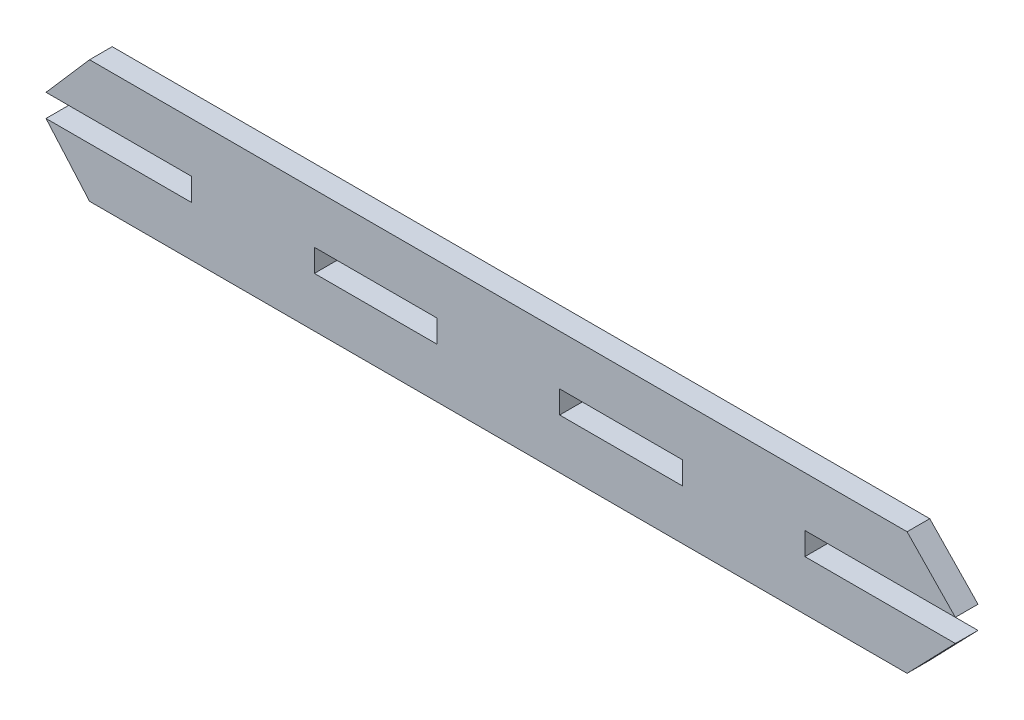
ISO-10303-21;
HEADER;
FILE_DESCRIPTION(('STEP AP214'),'2;1');
FILE_NAME('part.step','',(''),(''),'','','');
FILE_SCHEMA(('AUTOMOTIVE_DESIGN { 1 0 10303 214 1 1 1 1 }'));
ENDSEC;
DATA;
#1=APPLICATION_CONTEXT('core data for automotive mechanical design processes');
#2=APPLICATION_PROTOCOL_DEFINITION('international standard','automotive_design',2000,#1);
#3=PRODUCT_CONTEXT('',#1,'mechanical');
#4=PRODUCT('Part','Part','',(#3));
#5=PRODUCT_RELATED_PRODUCT_CATEGORY('part','',(#4));
#6=PRODUCT_DEFINITION_FORMATION('','',#4);
#7=PRODUCT_DEFINITION_CONTEXT('part definition',#1,'design');
#8=PRODUCT_DEFINITION('design','',#6,#7);
#9=PRODUCT_DEFINITION_SHAPE('','',#8);
#10=(LENGTH_UNIT() NAMED_UNIT(*) SI_UNIT(.MILLI.,.METRE.));
#11=(NAMED_UNIT(*) PLANE_ANGLE_UNIT() SI_UNIT($,.RADIAN.));
#12=(NAMED_UNIT(*) SI_UNIT($,.STERADIAN.) SOLID_ANGLE_UNIT());
#13=UNCERTAINTY_MEASURE_WITH_UNIT(LENGTH_MEASURE(1.E-05),#10,'distance_accuracy_value','');
#14=(GEOMETRIC_REPRESENTATION_CONTEXT(3) GLOBAL_UNCERTAINTY_ASSIGNED_CONTEXT((#13)) GLOBAL_UNIT_ASSIGNED_CONTEXT((#10,
#11,#12)) REPRESENTATION_CONTEXT('',''));
#15=CARTESIAN_POINT('',(0.,0.,0.));
#16=DIRECTION('',(0.,0.,1.));
#17=DIRECTION('',(1.,0.,0.));
#18=AXIS2_PLACEMENT_3D('',#15,#16,#17);
#19=CARTESIAN_POINT('',(0.,0.,5.54));
#20=DIRECTION('',(0.,0.,-1.));
#21=DIRECTION('',(-1.,0.,0.));
#22=AXIS2_PLACEMENT_3D('',#19,#20,#21);
#23=PLANE('',#22);
#24=DIRECTION('',(0.,-1.,0.));
#25=VECTOR('',#24,1.);
#26=CARTESIAN_POINT('',(185.883682838051,9.13527353806291,5.54));
#27=LINE('',#26,#25);
#28=CARTESIAN_POINT('',(185.883682838051,9.13527353806291,5.54));
#29=VERTEX_POINT('',#28);
#30=CARTESIAN_POINT('',(185.883682838051,3.59527353806291,5.54));
#31=VERTEX_POINT('',#30);
#32=EDGE_CURVE('E206',#29,#31,#27,.T.);
#33=ORIENTED_EDGE('',*,*,#32,.F.);
#34=DIRECTION('',(-1.,0.,0.));
#35=VECTOR('',#34,1.);
#36=CARTESIAN_POINT('',(185.883682838051,9.13527353806291,5.54));
#37=LINE('',#36,#35);
#38=CARTESIAN_POINT('',(215.883682838051,9.13527353806417,5.54));
#39=VERTEX_POINT('',#38);
#40=EDGE_CURVE('E214',#39,#29,#37,.T.);
#41=ORIENTED_EDGE('',*,*,#40,.F.);
#42=DIRECTION('',(0.,1.,0.));
#43=VECTOR('',#42,1.);
#44=CARTESIAN_POINT('',(215.883682838051,9.13527353806417,5.54));
#45=LINE('',#44,#43);
#46=CARTESIAN_POINT('',(215.883682838051,3.59527353806032,5.54));
#47=VERTEX_POINT('',#46);
#48=EDGE_CURVE('E211',#47,#39,#45,.T.);
#49=ORIENTED_EDGE('',*,*,#48,.F.);
#50=DIRECTION('',(1.,0.,0.));
#51=VECTOR('',#50,1.);
#52=CARTESIAN_POINT('',(185.883682838051,3.59527353806291,5.54));
#53=LINE('',#52,#51);
#54=EDGE_CURVE('E208',#31,#47,#53,.T.);
#55=ORIENTED_EDGE('',*,*,#54,.F.);
#56=EDGE_LOOP('',(#33,#41,#49,#55));
#57=FACE_BOUND('',#56,.T.);
#58=DIRECTION('',(-0.656899997261739,-0.753977714257874,0.));
#59=VECTOR('',#58,1.);
#60=CARTESIAN_POINT('',(60.2283453995707,9.13527353805765,5.54));
#61=LINE('',#60,#59);
#62=CARTESIAN_POINT('',(70.8836828380505,21.3652735380581,5.54));
#63=VERTEX_POINT('',#62);
#64=CARTESIAN_POINT('',(60.2283453995707,9.13527353805765,5.54));
#65=VERTEX_POINT('',#64);
#66=EDGE_CURVE('E237',#63,#65,#61,.T.);
#67=ORIENTED_EDGE('',*,*,#66,.T.);
#68=DIRECTION('',(1.,0.,0.));
#69=VECTOR('',#68,1.);
#70=CARTESIAN_POINT('',(60.2283453995707,9.13527353805765,5.54));
#71=LINE('',#70,#69);
#72=CARTESIAN_POINT('',(95.8836828380511,9.13527353805915,5.54));
#73=VERTEX_POINT('',#72);
#74=EDGE_CURVE('E240',#65,#73,#71,.T.);
#75=ORIENTED_EDGE('',*,*,#74,.T.);
#76=DIRECTION('',(0.,-1.,0.));
#77=VECTOR('',#76,1.);
#78=CARTESIAN_POINT('',(95.8836828380513,3.59527353805915,5.54));
#79=LINE('',#78,#77);
#80=CARTESIAN_POINT('',(95.8836828380513,3.59527353805915,5.54));
#81=VERTEX_POINT('',#80);
#82=EDGE_CURVE('E243',#73,#81,#79,.T.);
#83=ORIENTED_EDGE('',*,*,#82,.T.);
#84=DIRECTION('',(-1.,0.,0.));
#85=VECTOR('',#84,1.);
#86=CARTESIAN_POINT('',(60.2283453995709,3.59527353805765,5.54));
#87=LINE('',#86,#85);
#88=CARTESIAN_POINT('',(60.2283453995709,3.59527353805765,5.54));
#89=VERTEX_POINT('',#88);
#90=EDGE_CURVE('E245',#81,#89,#87,.T.);
#91=ORIENTED_EDGE('',*,*,#90,.T.);
#92=DIRECTION('',(0.65689999726181,-0.753977714257811,0.));
#93=VECTOR('',#92,1.);
#94=CARTESIAN_POINT('',(60.2283453995709,3.59527353805765,5.54));
#95=LINE('',#94,#93);
#96=CARTESIAN_POINT('',(70.883682838052,-8.6347264619419,5.54));
#97=VERTEX_POINT('',#96);
#98=EDGE_CURVE('E247',#89,#97,#95,.T.);
#99=ORIENTED_EDGE('',*,*,#98,.T.);
#100=DIRECTION('',(1.,0.,0.));
#101=VECTOR('',#100,1.);
#102=CARTESIAN_POINT('',(70.883682838052,-8.6347264619419,5.54));
#103=LINE('',#102,#101);
#104=CARTESIAN_POINT('',(270.883682838052,-8.63472646193352,5.54));
#105=VERTEX_POINT('',#104);
#106=EDGE_CURVE('E249',#97,#105,#103,.T.);
#107=ORIENTED_EDGE('',*,*,#106,.T.);
#108=DIRECTION('',(0.694449276487092,0.719541661327928,0.));
#109=VECTOR('',#108,1.);
#110=CARTESIAN_POINT('',(270.883682838052,-8.63472646193352,5.54));
#111=LINE('',#110,#109);
#112=CARTESIAN_POINT('',(282.687189303214,3.59527353806706,5.54));
#113=VERTEX_POINT('',#112);
#114=EDGE_CURVE('E251',#105,#113,#111,.T.);
#115=ORIENTED_EDGE('',*,*,#114,.T.);
#116=DIRECTION('',(-1.,0.,0.));
#117=VECTOR('',#116,1.);
#118=CARTESIAN_POINT('',(282.687189303214,3.59527353806706,5.54));
#119=LINE('',#118,#117);
#120=CARTESIAN_POINT('',(245.883682838051,3.59527353806552,5.54));
#121=VERTEX_POINT('',#120);
#122=EDGE_CURVE('E253',#113,#121,#119,.T.);
#123=ORIENTED_EDGE('',*,*,#122,.T.);
#124=DIRECTION('',(0.,1.,0.));
#125=VECTOR('',#124,1.);
#126=CARTESIAN_POINT('',(245.883682838051,3.59527353806552,5.54));
#127=LINE('',#126,#125);
#128=CARTESIAN_POINT('',(245.883682838051,9.13527353806552,5.54));
#129=VERTEX_POINT('',#128);
#130=EDGE_CURVE('E255',#121,#129,#127,.T.);
#131=ORIENTED_EDGE('',*,*,#130,.T.);
#132=DIRECTION('',(1.,0.,0.));
#133=VECTOR('',#132,1.);
#134=CARTESIAN_POINT('',(282.687189303214,9.13527353806706,5.54));
#135=LINE('',#134,#133);
#136=CARTESIAN_POINT('',(282.687189303214,9.13527353806706,5.54));
#137=VERTEX_POINT('',#136);
#138=EDGE_CURVE('E257',#129,#137,#135,.T.);
#139=ORIENTED_EDGE('',*,*,#138,.T.);
#140=DIRECTION('',(-0.694449276487162,0.71954166132786,0.));
#141=VECTOR('',#140,1.);
#142=CARTESIAN_POINT('',(270.883682838051,21.3652735380665,5.54));
#143=LINE('',#142,#141);
#144=CARTESIAN_POINT('',(270.883682838051,21.3652735380665,5.54));
#145=VERTEX_POINT('',#144);
#146=EDGE_CURVE('E259',#137,#145,#143,.T.);
#147=ORIENTED_EDGE('',*,*,#146,.T.);
#148=DIRECTION('',(-1.,0.,0.));
#149=VECTOR('',#148,1.);
#150=CARTESIAN_POINT('',(70.8836828380505,21.3652735380581,5.54));
#151=LINE('',#150,#149);
#152=EDGE_CURVE('E261',#145,#63,#151,.T.);
#153=ORIENTED_EDGE('',*,*,#152,.T.);
#154=EDGE_LOOP('',(#67,#75,#83,#91,#99,#107,#115,#123,#131,#139,#147,#153));
#155=FACE_BOUND('',#154,.T.);
#156=DIRECTION('',(-1.,0.,0.));
#157=VECTOR('',#156,1.);
#158=CARTESIAN_POINT('',(125.883682838051,9.1352735380599,5.54));
#159=LINE('',#158,#157);
#160=CARTESIAN_POINT('',(155.883682838051,9.13527353806074,5.54));
#161=VERTEX_POINT('',#160);
#162=CARTESIAN_POINT('',(125.883682838051,9.1352735380599,5.54));
#163=VERTEX_POINT('',#162);
#164=EDGE_CURVE('E170',#161,#163,#159,.T.);
#165=ORIENTED_EDGE('',*,*,#164,.F.);
#166=DIRECTION('',(0.,1.,0.));
#167=VECTOR('',#166,1.);
#168=CARTESIAN_POINT('',(155.883682838051,9.13527353806074,5.54));
#169=LINE('',#168,#167);
#170=CARTESIAN_POINT('',(155.883682838051,3.5952735380599,5.54));
#171=VERTEX_POINT('',#170);
#172=EDGE_CURVE('E192',#171,#161,#169,.T.);
#173=ORIENTED_EDGE('',*,*,#172,.F.);
#174=DIRECTION('',(1.,0.,0.));
#175=VECTOR('',#174,1.);
#176=CARTESIAN_POINT('',(125.883682838051,3.5952735380599,5.54));
#177=LINE('',#176,#175);
#178=CARTESIAN_POINT('',(125.883682838051,3.5952735380599,5.54));
#179=VERTEX_POINT('',#178);
#180=EDGE_CURVE('E190',#179,#171,#177,.T.);
#181=ORIENTED_EDGE('',*,*,#180,.F.);
#182=DIRECTION('',(0.,-1.,0.));
#183=VECTOR('',#182,1.);
#184=CARTESIAN_POINT('',(125.883682838051,9.1352735380599,5.54));
#185=LINE('',#184,#183);
#186=EDGE_CURVE('E178',#163,#179,#185,.T.);
#187=ORIENTED_EDGE('',*,*,#186,.F.);
#188=EDGE_LOOP('',(#165,#173,#181,#187));
#189=FACE_BOUND('',#188,.T.);
#190=ADVANCED_FACE('F33',(#57,#155,#189),#23,.F.);
#191=CARTESIAN_POINT('',(0.,0.,0.));
#192=DIRECTION('',(0.,0.,-1.));
#193=DIRECTION('',(-1.,0.,0.));
#194=AXIS2_PLACEMENT_3D('',#191,#192,#193);
#195=PLANE('',#194);
#196=DIRECTION('',(-0.656899997261739,-0.753977714257874,0.));
#197=VECTOR('',#196,1.);
#198=CARTESIAN_POINT('',(60.2283453995707,9.13527353805765,0.));
#199=LINE('',#198,#197);
#200=CARTESIAN_POINT('',(70.8836828380505,21.3652735380581,0.));
#201=VERTEX_POINT('',#200);
#202=CARTESIAN_POINT('',(60.2283453995707,9.13527353805765,0.));
#203=VERTEX_POINT('',#202);
#204=EDGE_CURVE('E236',#201,#203,#199,.T.);
#205=ORIENTED_EDGE('',*,*,#204,.F.);
#206=DIRECTION('',(-1.,0.,0.));
#207=VECTOR('',#206,1.);
#208=CARTESIAN_POINT('',(70.8836828380505,21.3652735380581,0.));
#209=LINE('',#208,#207);
#210=CARTESIAN_POINT('',(270.883682838051,21.3652735380665,0.));
#211=VERTEX_POINT('',#210);
#212=EDGE_CURVE('E241',#211,#201,#209,.T.);
#213=ORIENTED_EDGE('',*,*,#212,.F.);
#214=DIRECTION('',(-0.694449276487162,0.71954166132786,0.));
#215=VECTOR('',#214,1.);
#216=CARTESIAN_POINT('',(270.883682838051,21.3652735380665,0.));
#217=LINE('',#216,#215);
#218=CARTESIAN_POINT('',(282.687189303214,9.13527353806706,0.));
#219=VERTEX_POINT('',#218);
#220=EDGE_CURVE('E284',#219,#211,#217,.T.);
#221=ORIENTED_EDGE('',*,*,#220,.F.);
#222=DIRECTION('',(1.,0.,0.));
#223=VECTOR('',#222,1.);
#224=CARTESIAN_POINT('',(282.687189303214,9.13527353806706,0.));
#225=LINE('',#224,#223);
#226=CARTESIAN_POINT('',(245.883682838051,9.13527353806552,0.));
#227=VERTEX_POINT('',#226);
#228=EDGE_CURVE('E282',#227,#219,#225,.T.);
#229=ORIENTED_EDGE('',*,*,#228,.F.);
#230=DIRECTION('',(0.,1.,0.));
#231=VECTOR('',#230,1.);
#232=CARTESIAN_POINT('',(245.883682838051,3.59527353806552,0.));
#233=LINE('',#232,#231);
#234=CARTESIAN_POINT('',(245.883682838051,3.59527353806552,0.));
#235=VERTEX_POINT('',#234);
#236=EDGE_CURVE('E280',#235,#227,#233,.T.);
#237=ORIENTED_EDGE('',*,*,#236,.F.);
#238=DIRECTION('',(-1.,0.,0.));
#239=VECTOR('',#238,1.);
#240=CARTESIAN_POINT('',(282.687189303214,3.59527353806706,0.));
#241=LINE('',#240,#239);
#242=CARTESIAN_POINT('',(282.687189303214,3.59527353806706,0.));
#243=VERTEX_POINT('',#242);
#244=EDGE_CURVE('E278',#243,#235,#241,.T.);
#245=ORIENTED_EDGE('',*,*,#244,.F.);
#246=DIRECTION('',(0.694449276487092,0.719541661327928,0.));
#247=VECTOR('',#246,1.);
#248=CARTESIAN_POINT('',(270.883682838052,-8.63472646193352,0.));
#249=LINE('',#248,#247);
#250=CARTESIAN_POINT('',(270.883682838052,-8.63472646193352,0.));
#251=VERTEX_POINT('',#250);
#252=EDGE_CURVE('E276',#251,#243,#249,.T.);
#253=ORIENTED_EDGE('',*,*,#252,.F.);
#254=DIRECTION('',(1.,0.,0.));
#255=VECTOR('',#254,1.);
#256=CARTESIAN_POINT('',(70.883682838052,-8.6347264619419,0.));
#257=LINE('',#256,#255);
#258=CARTESIAN_POINT('',(70.883682838052,-8.6347264619419,0.));
#259=VERTEX_POINT('',#258);
#260=EDGE_CURVE('E274',#259,#251,#257,.T.);
#261=ORIENTED_EDGE('',*,*,#260,.F.);
#262=DIRECTION('',(0.65689999726181,-0.753977714257811,0.));
#263=VECTOR('',#262,1.);
#264=CARTESIAN_POINT('',(60.2283453995709,3.59527353805765,0.));
#265=LINE('',#264,#263);
#266=CARTESIAN_POINT('',(60.2283453995709,3.59527353805765,0.));
#267=VERTEX_POINT('',#266);
#268=EDGE_CURVE('E272',#267,#259,#265,.T.);
#269=ORIENTED_EDGE('',*,*,#268,.F.);
#270=DIRECTION('',(-1.,0.,0.));
#271=VECTOR('',#270,1.);
#272=CARTESIAN_POINT('',(60.2283453995709,3.59527353805765,0.));
#273=LINE('',#272,#271);
#274=CARTESIAN_POINT('',(95.8836828380513,3.59527353805915,0.));
#275=VERTEX_POINT('',#274);
#276=EDGE_CURVE('E270',#275,#267,#273,.T.);
#277=ORIENTED_EDGE('',*,*,#276,.F.);
#278=DIRECTION('',(0.,-1.,0.));
#279=VECTOR('',#278,1.);
#280=CARTESIAN_POINT('',(95.8836828380513,3.59527353805915,0.));
#281=LINE('',#280,#279);
#282=CARTESIAN_POINT('',(95.8836828380511,9.13527353805915,0.));
#283=VERTEX_POINT('',#282);
#284=EDGE_CURVE('E268',#283,#275,#281,.T.);
#285=ORIENTED_EDGE('',*,*,#284,.F.);
#286=DIRECTION('',(1.,0.,0.));
#287=VECTOR('',#286,1.);
#288=CARTESIAN_POINT('',(60.2283453995707,9.13527353805765,0.));
#289=LINE('',#288,#287);
#290=EDGE_CURVE('E266',#203,#283,#289,.T.);
#291=ORIENTED_EDGE('',*,*,#290,.F.);
#292=EDGE_LOOP('',(#205,#213,#221,#229,#237,#245,#253,#261,#269,#277,#285,#291));
#293=FACE_BOUND('',#292,.T.);
#294=DIRECTION('',(-1.,0.,0.));
#295=VECTOR('',#294,1.);
#296=CARTESIAN_POINT('',(185.883682838051,9.13527353806291,0.));
#297=LINE('',#296,#295);
#298=CARTESIAN_POINT('',(215.883682838051,9.13527353806417,0.));
#299=VERTEX_POINT('',#298);
#300=CARTESIAN_POINT('',(185.883682838051,9.13527353806291,0.));
#301=VERTEX_POINT('',#300);
#302=EDGE_CURVE('E209',#299,#301,#297,.T.);
#303=ORIENTED_EDGE('',*,*,#302,.T.);
#304=DIRECTION('',(0.,-1.,0.));
#305=VECTOR('',#304,1.);
#306=CARTESIAN_POINT('',(185.883682838051,9.13527353806291,0.));
#307=LINE('',#306,#305);
#308=CARTESIAN_POINT('',(185.883682838051,3.59527353806291,0.));
#309=VERTEX_POINT('',#308);
#310=EDGE_CURVE('E186',#301,#309,#307,.T.);
#311=ORIENTED_EDGE('',*,*,#310,.T.);
#312=DIRECTION('',(1.,0.,0.));
#313=VECTOR('',#312,1.);
#314=CARTESIAN_POINT('',(185.883682838051,3.59527353806291,0.));
#315=LINE('',#314,#313);
#316=CARTESIAN_POINT('',(215.883682838051,3.59527353806032,0.));
#317=VERTEX_POINT('',#316);
#318=EDGE_CURVE('E219',#309,#317,#315,.T.);
#319=ORIENTED_EDGE('',*,*,#318,.T.);
#320=DIRECTION('',(0.,1.,0.));
#321=VECTOR('',#320,1.);
#322=CARTESIAN_POINT('',(215.883682838051,9.13527353806417,0.));
#323=LINE('',#322,#321);
#324=EDGE_CURVE('E222',#317,#299,#323,.T.);
#325=ORIENTED_EDGE('',*,*,#324,.T.);
#326=EDGE_LOOP('',(#303,#311,#319,#325));
#327=FACE_BOUND('',#326,.T.);
#328=DIRECTION('',(0.,1.,0.));
#329=VECTOR('',#328,1.);
#330=CARTESIAN_POINT('',(155.883682838051,9.13527353806074,0.));
#331=LINE('',#330,#329);
#332=CARTESIAN_POINT('',(155.883682838051,3.5952735380599,0.));
#333=VERTEX_POINT('',#332);
#334=CARTESIAN_POINT('',(155.883682838051,9.13527353806074,0.));
#335=VERTEX_POINT('',#334);
#336=EDGE_CURVE('E179',#333,#335,#331,.T.);
#337=ORIENTED_EDGE('',*,*,#336,.T.);
#338=DIRECTION('',(-1.,0.,0.));
#339=VECTOR('',#338,1.);
#340=CARTESIAN_POINT('',(125.883682838051,9.1352735380599,0.));
#341=LINE('',#340,#339);
#342=CARTESIAN_POINT('',(125.883682838051,9.1352735380599,0.));
#343=VERTEX_POINT('',#342);
#344=EDGE_CURVE('E56',#335,#343,#341,.T.);
#345=ORIENTED_EDGE('',*,*,#344,.T.);
#346=DIRECTION('',(0.,-1.,0.));
#347=VECTOR('',#346,1.);
#348=CARTESIAN_POINT('',(125.883682838051,9.1352735380599,0.));
#349=LINE('',#348,#347);
#350=CARTESIAN_POINT('',(125.883682838051,3.5952735380599,0.));
#351=VERTEX_POINT('',#350);
#352=EDGE_CURVE('E185',#343,#351,#349,.T.);
#353=ORIENTED_EDGE('',*,*,#352,.T.);
#354=DIRECTION('',(1.,0.,0.));
#355=VECTOR('',#354,1.);
#356=CARTESIAN_POINT('',(125.883682838051,3.5952735380599,0.));
#357=LINE('',#356,#355);
#358=EDGE_CURVE('E198',#351,#333,#357,.T.);
#359=ORIENTED_EDGE('',*,*,#358,.T.);
#360=EDGE_LOOP('',(#337,#345,#353,#359));
#361=FACE_BOUND('',#360,.T.);
#362=ADVANCED_FACE('F326',(#293,#327,#361),#195,.T.);
#363=CARTESIAN_POINT('',(60.2283453995707,9.13527353805765,5.54));
#364=DIRECTION('',(0.753977714257874,-0.656899997261739,0.));
#365=DIRECTION('',(0.656899997261739,0.753977714257874,0.));
#366=AXIS2_PLACEMENT_3D('',#363,#364,#365);
#367=PLANE('',#366);
#368=ORIENTED_EDGE('',*,*,#204,.T.);
#369=DIRECTION('',(0.,0.,-1.));
#370=VECTOR('',#369,1.);
#371=CARTESIAN_POINT('',(60.2283453995707,9.13527353805765,5.54));
#372=LINE('',#371,#370);
#373=EDGE_CURVE('E11',#65,#203,#372,.T.);
#374=ORIENTED_EDGE('',*,*,#373,.F.);
#375=ORIENTED_EDGE('',*,*,#66,.F.);
#376=DIRECTION('',(0.,0.,-1.));
#377=VECTOR('',#376,1.);
#378=CARTESIAN_POINT('',(70.8836828380505,21.3652735380581,5.54));
#379=LINE('',#378,#377);
#380=EDGE_CURVE('E263',#63,#201,#379,.T.);
#381=ORIENTED_EDGE('',*,*,#380,.T.);
#382=EDGE_LOOP('',(#368,#374,#375,#381));
#383=FACE_BOUND('',#382,.T.);
#384=ADVANCED_FACE('F35',(#383),#367,.F.);
#385=CARTESIAN_POINT('',(60.2283453995707,9.13527353805765,5.54));
#386=DIRECTION('',(0.,1.,0.));
#387=DIRECTION('',(-1.,0.,0.));
#388=AXIS2_PLACEMENT_3D('',#385,#386,#387);
#389=PLANE('',#388);
#390=ORIENTED_EDGE('',*,*,#290,.T.);
#391=DIRECTION('',(0.,0.,-1.));
#392=VECTOR('',#391,1.);
#393=CARTESIAN_POINT('',(95.8836828380511,9.13527353805915,5.54));
#394=LINE('',#393,#392);
#395=EDGE_CURVE('E41',#73,#283,#394,.T.);
#396=ORIENTED_EDGE('',*,*,#395,.F.);
#397=ORIENTED_EDGE('',*,*,#74,.F.);
#398=ORIENTED_EDGE('',*,*,#373,.T.);
#399=EDGE_LOOP('',(#390,#396,#397,#398));
#400=FACE_BOUND('',#399,.T.);
#401=ADVANCED_FACE('F343',(#400),#389,.F.);
#402=CARTESIAN_POINT('',(95.8836828380513,3.59527353805915,5.54));
#403=DIRECTION('',(1.,0.,0.));
#404=DIRECTION('',(0.,1.,0.));
#405=AXIS2_PLACEMENT_3D('',#402,#403,#404);
#406=PLANE('',#405);
#407=ORIENTED_EDGE('',*,*,#284,.T.);
#408=DIRECTION('',(0.,0.,-1.));
#409=VECTOR('',#408,1.);
#410=CARTESIAN_POINT('',(95.8836828380513,3.59527353805915,5.54));
#411=LINE('',#410,#409);
#412=EDGE_CURVE('E313',#81,#275,#411,.T.);
#413=ORIENTED_EDGE('',*,*,#412,.F.);
#414=ORIENTED_EDGE('',*,*,#82,.F.);
#415=ORIENTED_EDGE('',*,*,#395,.T.);
#416=EDGE_LOOP('',(#407,#413,#414,#415));
#417=FACE_BOUND('',#416,.T.);
#418=ADVANCED_FACE('F320',(#417),#406,.F.);
#419=CARTESIAN_POINT('',(60.2283453995709,3.59527353805765,5.54));
#420=DIRECTION('',(0.,-1.,0.));
#421=DIRECTION('',(1.,0.,0.));
#422=AXIS2_PLACEMENT_3D('',#419,#420,#421);
#423=PLANE('',#422);
#424=ORIENTED_EDGE('',*,*,#276,.T.);
#425=DIRECTION('',(0.,0.,-1.));
#426=VECTOR('',#425,1.);
#427=CARTESIAN_POINT('',(60.2283453995709,3.59527353805765,5.54));
#428=LINE('',#427,#426);
#429=EDGE_CURVE('E310',#89,#267,#428,.T.);
#430=ORIENTED_EDGE('',*,*,#429,.F.);
#431=ORIENTED_EDGE('',*,*,#90,.F.);
#432=ORIENTED_EDGE('',*,*,#412,.T.);
#433=EDGE_LOOP('',(#424,#430,#431,#432));
#434=FACE_BOUND('',#433,.T.);
#435=ADVANCED_FACE('F332',(#434),#423,.F.);
#436=CARTESIAN_POINT('',(60.2283453995709,3.59527353805765,5.54));
#437=DIRECTION('',(0.753977714257811,0.65689999726181,0.));
#438=DIRECTION('',(-0.65689999726181,0.753977714257811,0.));
#439=AXIS2_PLACEMENT_3D('',#436,#437,#438);
#440=PLANE('',#439);
#441=ORIENTED_EDGE('',*,*,#268,.T.);
#442=DIRECTION('',(0.,0.,-1.));
#443=VECTOR('',#442,1.);
#444=CARTESIAN_POINT('',(70.883682838052,-8.6347264619419,5.54));
#445=LINE('',#444,#443);
#446=EDGE_CURVE('E307',#97,#259,#445,.T.);
#447=ORIENTED_EDGE('',*,*,#446,.F.);
#448=ORIENTED_EDGE('',*,*,#98,.F.);
#449=ORIENTED_EDGE('',*,*,#429,.T.);
#450=EDGE_LOOP('',(#441,#447,#448,#449));
#451=FACE_BOUND('',#450,.T.);
#452=ADVANCED_FACE('F336',(#451),#440,.F.);
#453=CARTESIAN_POINT('',(70.883682838052,-8.6347264619419,5.54));
#454=DIRECTION('',(0.,1.,0.));
#455=DIRECTION('',(-1.,0.,0.));
#456=AXIS2_PLACEMENT_3D('',#453,#454,#455);
#457=PLANE('',#456);
#458=ORIENTED_EDGE('',*,*,#260,.T.);
#459=DIRECTION('',(0.,0.,-1.));
#460=VECTOR('',#459,1.);
#461=CARTESIAN_POINT('',(270.883682838052,-8.63472646193352,5.54));
#462=LINE('',#461,#460);
#463=EDGE_CURVE('E304',#105,#251,#462,.T.);
#464=ORIENTED_EDGE('',*,*,#463,.F.);
#465=ORIENTED_EDGE('',*,*,#106,.F.);
#466=ORIENTED_EDGE('',*,*,#446,.T.);
#467=EDGE_LOOP('',(#458,#464,#465,#466));
#468=FACE_BOUND('',#467,.T.);
#469=ADVANCED_FACE('F376',(#468),#457,.F.);
#470=CARTESIAN_POINT('',(270.883682838052,-8.63472646193352,5.54));
#471=DIRECTION('',(-0.719541661327927,0.694449276487092,0.));
#472=DIRECTION('',(-0.694449276487092,-0.719541661327928,0.));
#473=AXIS2_PLACEMENT_3D('',#470,#471,#472);
#474=PLANE('',#473);
#475=ORIENTED_EDGE('',*,*,#252,.T.);
#476=DIRECTION('',(0.,0.,-1.));
#477=VECTOR('',#476,1.);
#478=CARTESIAN_POINT('',(282.687189303214,3.59527353806706,5.54));
#479=LINE('',#478,#477);
#480=EDGE_CURVE('E301',#113,#243,#479,.T.);
#481=ORIENTED_EDGE('',*,*,#480,.F.);
#482=ORIENTED_EDGE('',*,*,#114,.F.);
#483=ORIENTED_EDGE('',*,*,#463,.T.);
#484=EDGE_LOOP('',(#475,#481,#482,#483));
#485=FACE_BOUND('',#484,.T.);
#486=ADVANCED_FACE('F374',(#485),#474,.F.);
#487=CARTESIAN_POINT('',(282.687189303214,3.59527353806706,5.54));
#488=DIRECTION('',(0.,-1.,0.));
#489=DIRECTION('',(1.,0.,0.));
#490=AXIS2_PLACEMENT_3D('',#487,#488,#489);
#491=PLANE('',#490);
#492=ORIENTED_EDGE('',*,*,#244,.T.);
#493=DIRECTION('',(0.,0.,-1.));
#494=VECTOR('',#493,1.);
#495=CARTESIAN_POINT('',(245.883682838051,3.59527353806552,5.54));
#496=LINE('',#495,#494);
#497=EDGE_CURVE('E298',#121,#235,#496,.T.);
#498=ORIENTED_EDGE('',*,*,#497,.F.);
#499=ORIENTED_EDGE('',*,*,#122,.F.);
#500=ORIENTED_EDGE('',*,*,#480,.T.);
#501=EDGE_LOOP('',(#492,#498,#499,#500));
#502=FACE_BOUND('',#501,.T.);
#503=ADVANCED_FACE('F370',(#502),#491,.F.);
#504=CARTESIAN_POINT('',(245.883682838051,3.59527353806552,5.54));
#505=DIRECTION('',(-1.,0.,0.));
#506=DIRECTION('',(0.,-1.,0.));
#507=AXIS2_PLACEMENT_3D('',#504,#505,#506);
#508=PLANE('',#507);
#509=ORIENTED_EDGE('',*,*,#236,.T.);
#510=DIRECTION('',(0.,0.,-1.));
#511=VECTOR('',#510,1.);
#512=CARTESIAN_POINT('',(245.883682838051,9.13527353806552,5.54));
#513=LINE('',#512,#511);
#514=EDGE_CURVE('E295',#129,#227,#513,.T.);
#515=ORIENTED_EDGE('',*,*,#514,.F.);
#516=ORIENTED_EDGE('',*,*,#130,.F.);
#517=ORIENTED_EDGE('',*,*,#497,.T.);
#518=EDGE_LOOP('',(#509,#515,#516,#517));
#519=FACE_BOUND('',#518,.T.);
#520=ADVANCED_FACE('F365',(#519),#508,.F.);
#521=CARTESIAN_POINT('',(282.687189303214,9.13527353806706,5.54));
#522=DIRECTION('',(0.,1.,0.));
#523=DIRECTION('',(-1.,0.,0.));
#524=AXIS2_PLACEMENT_3D('',#521,#522,#523);
#525=PLANE('',#524);
#526=ORIENTED_EDGE('',*,*,#228,.T.);
#527=DIRECTION('',(0.,0.,-1.));
#528=VECTOR('',#527,1.);
#529=CARTESIAN_POINT('',(282.687189303214,9.13527353806706,5.54));
#530=LINE('',#529,#528);
#531=EDGE_CURVE('E292',#137,#219,#530,.T.);
#532=ORIENTED_EDGE('',*,*,#531,.F.);
#533=ORIENTED_EDGE('',*,*,#138,.F.);
#534=ORIENTED_EDGE('',*,*,#514,.T.);
#535=EDGE_LOOP('',(#526,#532,#533,#534));
#536=FACE_BOUND('',#535,.T.);
#537=ADVANCED_FACE('F359',(#536),#525,.F.);
#538=CARTESIAN_POINT('',(270.883682838051,21.3652735380665,5.54));
#539=DIRECTION('',(-0.71954166132786,-0.694449276487162,0.));
#540=DIRECTION('',(0.694449276487162,-0.71954166132786,0.));
#541=AXIS2_PLACEMENT_3D('',#538,#539,#540);
#542=PLANE('',#541);
#543=ORIENTED_EDGE('',*,*,#220,.T.);
#544=DIRECTION('',(0.,0.,-1.));
#545=VECTOR('',#544,1.);
#546=CARTESIAN_POINT('',(270.883682838051,21.3652735380665,5.54));
#547=LINE('',#546,#545);
#548=EDGE_CURVE('E289',#145,#211,#547,.T.);
#549=ORIENTED_EDGE('',*,*,#548,.F.);
#550=ORIENTED_EDGE('',*,*,#146,.F.);
#551=ORIENTED_EDGE('',*,*,#531,.T.);
#552=EDGE_LOOP('',(#543,#549,#550,#551));
#553=FACE_BOUND('',#552,.T.);
#554=ADVANCED_FACE('F355',(#553),#542,.F.);
#555=CARTESIAN_POINT('',(70.8836828380505,21.3652735380581,5.54));
#556=DIRECTION('',(0.,-1.,0.));
#557=DIRECTION('',(1.,0.,0.));
#558=AXIS2_PLACEMENT_3D('',#555,#556,#557);
#559=PLANE('',#558);
#560=ORIENTED_EDGE('',*,*,#212,.T.);
#561=ORIENTED_EDGE('',*,*,#380,.F.);
#562=ORIENTED_EDGE('',*,*,#152,.F.);
#563=ORIENTED_EDGE('',*,*,#548,.T.);
#564=EDGE_LOOP('',(#560,#561,#562,#563));
#565=FACE_BOUND('',#564,.T.);
#566=ADVANCED_FACE('F350',(#565),#559,.F.);
#567=CARTESIAN_POINT('',(185.883682838051,9.13527353806291,5.54));
#568=DIRECTION('',(1.,0.,0.));
#569=DIRECTION('',(0.,0.,-1.));
#570=AXIS2_PLACEMENT_3D('',#567,#568,#569);
#571=PLANE('',#570);
#572=ORIENTED_EDGE('',*,*,#310,.F.);
#573=DIRECTION('',(0.,0.,-1.));
#574=VECTOR('',#573,1.);
#575=CARTESIAN_POINT('',(185.883682838051,9.13527353806291,5.54));
#576=LINE('',#575,#574);
#577=EDGE_CURVE('E216',#29,#301,#576,.T.);
#578=ORIENTED_EDGE('',*,*,#577,.F.);
#579=ORIENTED_EDGE('',*,*,#32,.T.);
#580=DIRECTION('',(0.,0.,-1.));
#581=VECTOR('',#580,1.);
#582=CARTESIAN_POINT('',(185.883682838051,3.59527353806291,5.54));
#583=LINE('',#582,#581);
#584=EDGE_CURVE('E233',#31,#309,#583,.T.);
#585=ORIENTED_EDGE('',*,*,#584,.T.);
#586=EDGE_LOOP('',(#572,#578,#579,#585));
#587=FACE_BOUND('',#586,.T.);
#588=ADVANCED_FACE('F394',(#587),#571,.T.);
#589=CARTESIAN_POINT('',(185.883682838051,3.59527353806291,5.54));
#590=DIRECTION('',(0.,1.,0.));
#591=DIRECTION('',(-1.,0.,0.));
#592=AXIS2_PLACEMENT_3D('',#589,#590,#591);
#593=PLANE('',#592);
#594=ORIENTED_EDGE('',*,*,#318,.F.);
#595=ORIENTED_EDGE('',*,*,#584,.F.);
#596=ORIENTED_EDGE('',*,*,#54,.T.);
#597=DIRECTION('',(0.,0.,-1.));
#598=VECTOR('',#597,1.);
#599=CARTESIAN_POINT('',(215.883682838051,3.59527353806032,5.54));
#600=LINE('',#599,#598);
#601=EDGE_CURVE('E231',#47,#317,#600,.T.);
#602=ORIENTED_EDGE('',*,*,#601,.T.);
#603=EDGE_LOOP('',(#594,#595,#596,#602));
#604=FACE_BOUND('',#603,.T.);
#605=ADVANCED_FACE('F432',(#604),#593,.T.);
#606=CARTESIAN_POINT('',(215.883682838051,9.13527353806417,5.54));
#607=DIRECTION('',(-1.,0.,0.));
#608=DIRECTION('',(0.,-1.,0.));
#609=AXIS2_PLACEMENT_3D('',#606,#607,#608);
#610=PLANE('',#609);
#611=ORIENTED_EDGE('',*,*,#324,.F.);
#612=ORIENTED_EDGE('',*,*,#601,.F.);
#613=ORIENTED_EDGE('',*,*,#48,.T.);
#614=DIRECTION('',(0.,0.,-1.));
#615=VECTOR('',#614,1.);
#616=CARTESIAN_POINT('',(215.883682838051,9.13527353806417,5.54));
#617=LINE('',#616,#615);
#618=EDGE_CURVE('E229',#39,#299,#617,.T.);
#619=ORIENTED_EDGE('',*,*,#618,.T.);
#620=EDGE_LOOP('',(#611,#612,#613,#619));
#621=FACE_BOUND('',#620,.T.);
#622=ADVANCED_FACE('F439',(#621),#610,.T.);
#623=CARTESIAN_POINT('',(185.883682838051,9.13527353806291,5.54));
#624=DIRECTION('',(0.,-1.,0.));
#625=DIRECTION('',(1.,0.,0.));
#626=AXIS2_PLACEMENT_3D('',#623,#624,#625);
#627=PLANE('',#626);
#628=ORIENTED_EDGE('',*,*,#302,.F.);
#629=ORIENTED_EDGE('',*,*,#618,.F.);
#630=ORIENTED_EDGE('',*,*,#40,.T.);
#631=ORIENTED_EDGE('',*,*,#577,.T.);
#632=EDGE_LOOP('',(#628,#629,#630,#631));
#633=FACE_BOUND('',#632,.T.);
#634=ADVANCED_FACE('F446',(#633),#627,.T.);
#635=CARTESIAN_POINT('',(125.883682838051,9.1352735380599,5.54));
#636=DIRECTION('',(0.,-1.,0.));
#637=DIRECTION('',(1.,0.,0.));
#638=AXIS2_PLACEMENT_3D('',#635,#636,#637);
#639=PLANE('',#638);
#640=ORIENTED_EDGE('',*,*,#344,.F.);
#641=DIRECTION('',(0.,0.,-1.));
#642=VECTOR('',#641,1.);
#643=CARTESIAN_POINT('',(155.883682838051,9.13527353806074,5.54));
#644=LINE('',#643,#642);
#645=EDGE_CURVE('E174',#161,#335,#644,.T.);
#646=ORIENTED_EDGE('',*,*,#645,.F.);
#647=ORIENTED_EDGE('',*,*,#164,.T.);
#648=DIRECTION('',(0.,0.,-1.));
#649=VECTOR('',#648,1.);
#650=CARTESIAN_POINT('',(125.883682838051,9.1352735380599,5.54));
#651=LINE('',#650,#649);
#652=EDGE_CURVE('E173',#163,#343,#651,.T.);
#653=ORIENTED_EDGE('',*,*,#652,.T.);
#654=EDGE_LOOP('',(#640,#646,#647,#653));
#655=FACE_BOUND('',#654,.T.);
#656=ADVANCED_FACE('F172',(#655),#639,.T.);
#657=CARTESIAN_POINT('',(125.883682838051,9.1352735380599,5.54));
#658=DIRECTION('',(1.,0.,0.));
#659=DIRECTION('',(0.,0.,-1.));
#660=AXIS2_PLACEMENT_3D('',#657,#658,#659);
#661=PLANE('',#660);
#662=ORIENTED_EDGE('',*,*,#352,.F.);
#663=ORIENTED_EDGE('',*,*,#652,.F.);
#664=ORIENTED_EDGE('',*,*,#186,.T.);
#665=DIRECTION('',(0.,0.,-1.));
#666=VECTOR('',#665,1.);
#667=CARTESIAN_POINT('',(125.883682838051,3.5952735380599,5.54));
#668=LINE('',#667,#666);
#669=EDGE_CURVE('E187',#179,#351,#668,.T.);
#670=ORIENTED_EDGE('',*,*,#669,.T.);
#671=EDGE_LOOP('',(#662,#663,#664,#670));
#672=FACE_BOUND('',#671,.T.);
#673=ADVANCED_FACE('F182',(#672),#661,.T.);
#674=CARTESIAN_POINT('',(125.883682838051,3.5952735380599,5.54));
#675=DIRECTION('',(0.,1.,0.));
#676=DIRECTION('',(0.,0.,1.));
#677=AXIS2_PLACEMENT_3D('',#674,#675,#676);
#678=PLANE('',#677);
#679=ORIENTED_EDGE('',*,*,#358,.F.);
#680=ORIENTED_EDGE('',*,*,#669,.F.);
#681=ORIENTED_EDGE('',*,*,#180,.T.);
#682=DIRECTION('',(0.,0.,-1.));
#683=VECTOR('',#682,1.);
#684=CARTESIAN_POINT('',(155.883682838051,3.5952735380599,5.54));
#685=LINE('',#684,#683);
#686=EDGE_CURVE('E48',#171,#333,#685,.T.);
#687=ORIENTED_EDGE('',*,*,#686,.T.);
#688=EDGE_LOOP('',(#679,#680,#681,#687));
#689=FACE_BOUND('',#688,.T.);
#690=ADVANCED_FACE('F467',(#689),#678,.T.);
#691=CARTESIAN_POINT('',(155.883682838051,9.13527353806074,5.54));
#692=DIRECTION('',(-1.,0.,0.));
#693=DIRECTION('',(0.,-1.,0.));
#694=AXIS2_PLACEMENT_3D('',#691,#692,#693);
#695=PLANE('',#694);
#696=ORIENTED_EDGE('',*,*,#336,.F.);
#697=ORIENTED_EDGE('',*,*,#686,.F.);
#698=ORIENTED_EDGE('',*,*,#172,.T.);
#699=ORIENTED_EDGE('',*,*,#645,.T.);
#700=EDGE_LOOP('',(#696,#697,#698,#699));
#701=FACE_BOUND('',#700,.T.);
#702=ADVANCED_FACE('F474',(#701),#695,.T.);
#703=CLOSED_SHELL('',(#190,#362,#384,#401,#418,#435,#452,#469,#486,#503,#520,#537,#554,#566,
#588,#605,#622,#634,#656,#673,#690,#702));
#704=MANIFOLD_SOLID_BREP('B2',#703);
#705=ADVANCED_BREP_SHAPE_REPRESENTATION('',(#18,#704),#14);
#706=SHAPE_DEFINITION_REPRESENTATION(#9,#705);
ENDSEC;
END-ISO-10303-21;
